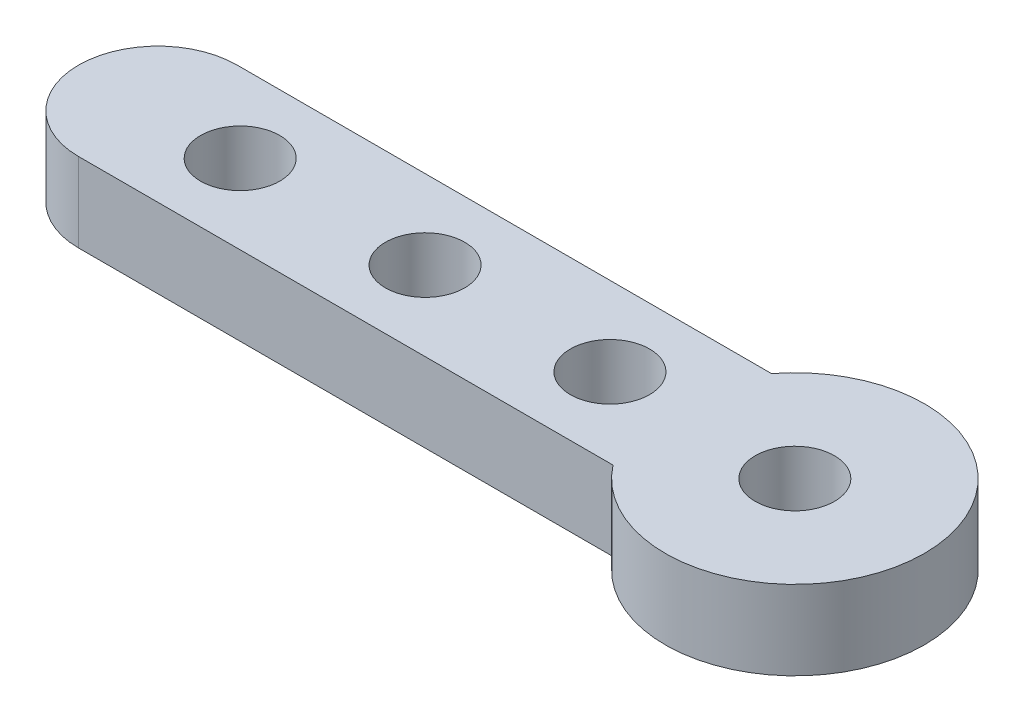
ISO-10303-21;
HEADER;
FILE_DESCRIPTION(('STEP AP214'),'2;1');
FILE_NAME('part.step','',(''),(''),'','','');
FILE_SCHEMA(('AUTOMOTIVE_DESIGN { 1 0 10303 214 1 1 1 1 }'));
ENDSEC;
DATA;
#1=APPLICATION_CONTEXT('core data for automotive mechanical design processes');
#2=APPLICATION_PROTOCOL_DEFINITION('international standard','automotive_design',2000,#1);
#3=PRODUCT_CONTEXT('',#1,'mechanical');
#4=PRODUCT('Part','Part','',(#3));
#5=PRODUCT_RELATED_PRODUCT_CATEGORY('part','',(#4));
#6=PRODUCT_DEFINITION_FORMATION('','',#4);
#7=PRODUCT_DEFINITION_CONTEXT('part definition',#1,'design');
#8=PRODUCT_DEFINITION('design','',#6,#7);
#9=PRODUCT_DEFINITION_SHAPE('','',#8);
#10=(LENGTH_UNIT() NAMED_UNIT(*) SI_UNIT(.MILLI.,.METRE.));
#11=(NAMED_UNIT(*) PLANE_ANGLE_UNIT() SI_UNIT($,.RADIAN.));
#12=(NAMED_UNIT(*) SI_UNIT($,.STERADIAN.) SOLID_ANGLE_UNIT());
#13=UNCERTAINTY_MEASURE_WITH_UNIT(LENGTH_MEASURE(1.E-05),#10,'distance_accuracy_value','');
#14=(GEOMETRIC_REPRESENTATION_CONTEXT(3) GLOBAL_UNCERTAINTY_ASSIGNED_CONTEXT((#13)) GLOBAL_UNIT_ASSIGNED_CONTEXT((#10,
#11,#12)) REPRESENTATION_CONTEXT('',''));
#15=CARTESIAN_POINT('',(0.,0.,0.));
#16=DIRECTION('',(0.,0.,1.));
#17=DIRECTION('',(1.,0.,0.));
#18=AXIS2_PLACEMENT_3D('',#15,#16,#17);
#19=CARTESIAN_POINT('',(4.88385795269048,3.,-3.));
#20=DIRECTION('',(0.,1.,0.));
#21=DIRECTION('',(0.,0.,1.));
#22=AXIS2_PLACEMENT_3D('',#19,#20,#21);
#23=PLANE('',#22);
#24=CARTESIAN_POINT('',(15.,3.,-3.));
#25=DIRECTION('',(0.,1.,0.));
#26=DIRECTION('',(0.,0.,1.));
#27=AXIS2_PLACEMENT_3D('',#24,#25,#26);
#28=CIRCLE('',#27,1.5);
#29=CARTESIAN_POINT('',(15.,3.,-1.5));
#30=VERTEX_POINT('',#29);
#31=EDGE_CURVE('E172',#30,#30,#28,.T.);
#32=ORIENTED_EDGE('',*,*,#31,.F.);
#33=EDGE_LOOP('',(#32));
#34=FACE_BOUND('',#33,.T.);
#35=CARTESIAN_POINT('',(4.88385795269048,3.,-3.));
#36=DIRECTION('',(0.,1.,0.));
#37=DIRECTION('',(0.,0.,1.));
#38=AXIS2_PLACEMENT_3D('',#35,#36,#37);
#39=CIRCLE('',#38,3.);
#40=CARTESIAN_POINT('',(4.88385795269048,3.,-6.));
#41=VERTEX_POINT('',#40);
#42=CARTESIAN_POINT('',(4.88385795269048,3.,0.));
#43=VERTEX_POINT('',#42);
#44=EDGE_CURVE('E143',#41,#43,#39,.T.);
#45=ORIENTED_EDGE('',*,*,#44,.T.);
#46=DIRECTION('',(1.,0.,0.));
#47=VECTOR('',#46,1.);
#48=CARTESIAN_POINT('',(4.88385795269048,3.,0.));
#49=LINE('',#48,#47);
#50=CARTESIAN_POINT('',(25.1161420473095,3.,0.));
#51=VERTEX_POINT('',#50);
#52=EDGE_CURVE('E135',#43,#51,#49,.T.);
#53=ORIENTED_EDGE('',*,*,#52,.T.);
#54=CARTESIAN_POINT('',(29.,3.,-3.));
#55=DIRECTION('',(0.,-1.,0.));
#56=DIRECTION('',(0.,0.,-1.));
#57=AXIS2_PLACEMENT_3D('',#54,#55,#56);
#58=CIRCLE('',#57,4.90758113500705);
#59=CARTESIAN_POINT('',(25.1161420473095,3.,-6.));
#60=VERTEX_POINT('',#59);
#61=EDGE_CURVE('E142',#60,#51,#58,.T.);
#62=ORIENTED_EDGE('',*,*,#61,.F.);
#63=DIRECTION('',(1.,0.,0.));
#64=VECTOR('',#63,1.);
#65=CARTESIAN_POINT('',(4.88385795269048,3.,-6.));
#66=LINE('',#65,#64);
#67=EDGE_CURVE('E152',#41,#60,#66,.T.);
#68=ORIENTED_EDGE('',*,*,#67,.F.);
#69=EDGE_LOOP('',(#45,#53,#62,#68));
#70=FACE_BOUND('',#69,.T.);
#71=CARTESIAN_POINT('',(8.,3.,-3.));
#72=DIRECTION('',(0.,1.,0.));
#73=DIRECTION('',(0.,0.,1.));
#74=AXIS2_PLACEMENT_3D('',#71,#72,#73);
#75=CIRCLE('',#74,1.5);
#76=CARTESIAN_POINT('',(8.,3.,-1.5));
#77=VERTEX_POINT('',#76);
#78=EDGE_CURVE('E159',#77,#77,#75,.T.);
#79=ORIENTED_EDGE('',*,*,#78,.F.);
#80=EDGE_LOOP('',(#79));
#81=FACE_BOUND('',#80,.T.);
#82=CARTESIAN_POINT('',(22.,3.,-3.));
#83=DIRECTION('',(0.,-1.,0.));
#84=DIRECTION('',(0.,0.,-1.));
#85=AXIS2_PLACEMENT_3D('',#82,#83,#84);
#86=CIRCLE('',#85,1.5);
#87=CARTESIAN_POINT('',(22.,3.,-4.5));
#88=VERTEX_POINT('',#87);
#89=EDGE_CURVE('E178',#88,#88,#86,.T.);
#90=ORIENTED_EDGE('',*,*,#89,.T.);
#91=EDGE_LOOP('',(#90));
#92=FACE_BOUND('',#91,.T.);
#93=CARTESIAN_POINT('',(29.,3.,-3.));
#94=DIRECTION('',(0.,1.,0.));
#95=DIRECTION('',(0.,0.,1.));
#96=AXIS2_PLACEMENT_3D('',#93,#94,#95);
#97=CIRCLE('',#96,1.5);
#98=CARTESIAN_POINT('',(29.,3.,-1.5));
#99=VERTEX_POINT('',#98);
#100=EDGE_CURVE('E184',#99,#99,#97,.T.);
#101=ORIENTED_EDGE('',*,*,#100,.F.);
#102=EDGE_LOOP('',(#101));
#103=FACE_BOUND('',#102,.T.);
#104=ADVANCED_FACE('F93',(#34,#70,#81,#92,#103),#23,.T.);
#105=CARTESIAN_POINT('',(4.88385795269048,0.,-3.));
#106=DIRECTION('',(0.,1.,0.));
#107=DIRECTION('',(0.,0.,1.));
#108=AXIS2_PLACEMENT_3D('',#105,#106,#107);
#109=PLANE('',#108);
#110=CARTESIAN_POINT('',(22.,0.,-3.));
#111=DIRECTION('',(0.,-1.,0.));
#112=DIRECTION('',(0.,0.,-1.));
#113=AXIS2_PLACEMENT_3D('',#110,#111,#112);
#114=CIRCLE('',#113,1.5);
#115=CARTESIAN_POINT('',(22.,0.,-4.5));
#116=VERTEX_POINT('',#115);
#117=EDGE_CURVE('E181',#116,#116,#114,.T.);
#118=ORIENTED_EDGE('',*,*,#117,.F.);
#119=EDGE_LOOP('',(#118));
#120=FACE_BOUND('',#119,.T.);
#121=CARTESIAN_POINT('',(4.88385795269048,0.,-3.));
#122=DIRECTION('',(0.,1.,0.));
#123=DIRECTION('',(0.,0.,1.));
#124=AXIS2_PLACEMENT_3D('',#121,#122,#123);
#125=CIRCLE('',#124,3.);
#126=CARTESIAN_POINT('',(4.88385795269048,0.,-6.));
#127=VERTEX_POINT('',#126);
#128=CARTESIAN_POINT('',(4.88385795269048,0.,0.));
#129=VERTEX_POINT('',#128);
#130=EDGE_CURVE('E157',#127,#129,#125,.T.);
#131=ORIENTED_EDGE('',*,*,#130,.F.);
#132=DIRECTION('',(1.,0.,0.));
#133=VECTOR('',#132,1.);
#134=CARTESIAN_POINT('',(4.88385795269048,0.,-6.));
#135=LINE('',#134,#133);
#136=CARTESIAN_POINT('',(25.1161420473095,0.,-6.));
#137=VERTEX_POINT('',#136);
#138=EDGE_CURVE('E163',#127,#137,#135,.T.);
#139=ORIENTED_EDGE('',*,*,#138,.T.);
#140=CARTESIAN_POINT('',(29.,0.,-3.));
#141=DIRECTION('',(0.,-1.,0.));
#142=DIRECTION('',(0.,0.,-1.));
#143=AXIS2_PLACEMENT_3D('',#140,#141,#142);
#144=CIRCLE('',#143,4.90758113500705);
#145=CARTESIAN_POINT('',(25.1161420473095,0.,0.));
#146=VERTEX_POINT('',#145);
#147=EDGE_CURVE('E161',#137,#146,#144,.T.);
#148=ORIENTED_EDGE('',*,*,#147,.T.);
#149=DIRECTION('',(1.,0.,0.));
#150=VECTOR('',#149,1.);
#151=CARTESIAN_POINT('',(4.88385795269048,0.,0.));
#152=LINE('',#151,#150);
#153=EDGE_CURVE('E148',#129,#146,#152,.T.);
#154=ORIENTED_EDGE('',*,*,#153,.F.);
#155=EDGE_LOOP('',(#131,#139,#148,#154));
#156=FACE_BOUND('',#155,.T.);
#157=CARTESIAN_POINT('',(8.,0.,-3.));
#158=DIRECTION('',(0.,1.,0.));
#159=DIRECTION('',(0.,0.,1.));
#160=AXIS2_PLACEMENT_3D('',#157,#158,#159);
#161=CIRCLE('',#160,1.5);
#162=CARTESIAN_POINT('',(8.,0.,-1.5));
#163=VERTEX_POINT('',#162);
#164=EDGE_CURVE('E169',#163,#163,#161,.T.);
#165=ORIENTED_EDGE('',*,*,#164,.T.);
#166=EDGE_LOOP('',(#165));
#167=FACE_BOUND('',#166,.T.);
#168=CARTESIAN_POINT('',(15.,0.,-3.));
#169=DIRECTION('',(0.,1.,0.));
#170=DIRECTION('',(0.,0.,1.));
#171=AXIS2_PLACEMENT_3D('',#168,#169,#170);
#172=CIRCLE('',#171,1.5);
#173=CARTESIAN_POINT('',(15.,0.,-1.5));
#174=VERTEX_POINT('',#173);
#175=EDGE_CURVE('E175',#174,#174,#172,.T.);
#176=ORIENTED_EDGE('',*,*,#175,.T.);
#177=EDGE_LOOP('',(#176));
#178=FACE_BOUND('',#177,.T.);
#179=CARTESIAN_POINT('',(29.,0.,-3.));
#180=DIRECTION('',(0.,1.,0.));
#181=DIRECTION('',(0.,0.,1.));
#182=AXIS2_PLACEMENT_3D('',#179,#180,#181);
#183=CIRCLE('',#182,1.5);
#184=CARTESIAN_POINT('',(29.,0.,-1.5));
#185=VERTEX_POINT('',#184);
#186=EDGE_CURVE('E187',#185,#185,#183,.T.);
#187=ORIENTED_EDGE('',*,*,#186,.T.);
#188=EDGE_LOOP('',(#187));
#189=FACE_BOUND('',#188,.T.);
#190=ADVANCED_FACE('F197',(#120,#156,#167,#178,#189),#109,.F.);
#191=CARTESIAN_POINT('',(4.88385795269048,3.,-3.));
#192=DIRECTION('',(0.,-1.,0.));
#193=DIRECTION('',(0.,0.,-1.));
#194=AXIS2_PLACEMENT_3D('',#191,#192,#193);
#195=CYLINDRICAL_SURFACE('',#194,3.);
#196=ORIENTED_EDGE('',*,*,#130,.T.);
#197=DIRECTION('',(0.,-1.,0.));
#198=VECTOR('',#197,1.);
#199=CARTESIAN_POINT('',(4.88385795269048,3.,0.));
#200=LINE('',#199,#198);
#201=EDGE_CURVE('E12',#43,#129,#200,.T.);
#202=ORIENTED_EDGE('',*,*,#201,.F.);
#203=ORIENTED_EDGE('',*,*,#44,.F.);
#204=DIRECTION('',(0.,-1.,0.));
#205=VECTOR('',#204,1.);
#206=CARTESIAN_POINT('',(4.88385795269048,3.,-6.));
#207=LINE('',#206,#205);
#208=EDGE_CURVE('E110',#41,#127,#207,.T.);
#209=ORIENTED_EDGE('',*,*,#208,.T.);
#210=EDGE_LOOP('',(#196,#202,#203,#209));
#211=FACE_BOUND('',#210,.T.);
#212=ADVANCED_FACE('F95',(#211),#195,.T.);
#213=CARTESIAN_POINT('',(4.88385795269048,3.,0.));
#214=DIRECTION('',(0.,0.,-1.));
#215=DIRECTION('',(-1.,0.,0.));
#216=AXIS2_PLACEMENT_3D('',#213,#214,#215);
#217=PLANE('',#216);
#218=ORIENTED_EDGE('',*,*,#153,.T.);
#219=DIRECTION('',(0.,-1.,0.));
#220=VECTOR('',#219,1.);
#221=CARTESIAN_POINT('',(25.1161420473095,3.,0.));
#222=LINE('',#221,#220);
#223=EDGE_CURVE('E102',#51,#146,#222,.T.);
#224=ORIENTED_EDGE('',*,*,#223,.F.);
#225=ORIENTED_EDGE('',*,*,#52,.F.);
#226=ORIENTED_EDGE('',*,*,#201,.T.);
#227=EDGE_LOOP('',(#218,#224,#225,#226));
#228=FACE_BOUND('',#227,.T.);
#229=ADVANCED_FACE('F147',(#228),#217,.F.);
#230=CARTESIAN_POINT('',(29.,3.,-3.));
#231=DIRECTION('',(0.,-1.,0.));
#232=DIRECTION('',(0.,0.,-1.));
#233=AXIS2_PLACEMENT_3D('',#230,#231,#232);
#234=CYLINDRICAL_SURFACE('',#233,4.90758113500705);
#235=ORIENTED_EDGE('',*,*,#147,.F.);
#236=DIRECTION('',(0.,-1.,0.));
#237=VECTOR('',#236,1.);
#238=CARTESIAN_POINT('',(25.1161420473095,3.,-6.));
#239=LINE('',#238,#237);
#240=EDGE_CURVE('E124',#60,#137,#239,.T.);
#241=ORIENTED_EDGE('',*,*,#240,.F.);
#242=ORIENTED_EDGE('',*,*,#61,.T.);
#243=ORIENTED_EDGE('',*,*,#223,.T.);
#244=EDGE_LOOP('',(#235,#241,#242,#243));
#245=FACE_BOUND('',#244,.T.);
#246=ADVANCED_FACE('F151',(#245),#234,.T.);
#247=CARTESIAN_POINT('',(4.88385795269048,3.,-6.));
#248=DIRECTION('',(0.,0.,-1.));
#249=DIRECTION('',(-1.,0.,0.));
#250=AXIS2_PLACEMENT_3D('',#247,#248,#249);
#251=PLANE('',#250);
#252=ORIENTED_EDGE('',*,*,#138,.F.);
#253=ORIENTED_EDGE('',*,*,#208,.F.);
#254=ORIENTED_EDGE('',*,*,#67,.T.);
#255=ORIENTED_EDGE('',*,*,#240,.T.);
#256=EDGE_LOOP('',(#252,#253,#254,#255));
#257=FACE_BOUND('',#256,.T.);
#258=ADVANCED_FACE('F210',(#257),#251,.T.);
#259=CARTESIAN_POINT('',(8.,3.,-3.));
#260=DIRECTION('',(0.,-1.,0.));
#261=DIRECTION('',(0.,0.,-1.));
#262=AXIS2_PLACEMENT_3D('',#259,#260,#261);
#263=CYLINDRICAL_SURFACE('',#262,1.5);
#264=ORIENTED_EDGE('',*,*,#78,.T.);
#265=EDGE_LOOP('',(#264));
#266=FACE_BOUND('',#265,.T.);
#267=ORIENTED_EDGE('',*,*,#164,.F.);
#268=EDGE_LOOP('',(#267));
#269=FACE_BOUND('',#268,.T.);
#270=ADVANCED_FACE('F207',(#266,#269),#263,.F.);
#271=CARTESIAN_POINT('',(15.,3.,-3.));
#272=DIRECTION('',(0.,-1.,0.));
#273=DIRECTION('',(0.,0.,-1.));
#274=AXIS2_PLACEMENT_3D('',#271,#272,#273);
#275=CYLINDRICAL_SURFACE('',#274,1.5);
#276=ORIENTED_EDGE('',*,*,#31,.T.);
#277=EDGE_LOOP('',(#276));
#278=FACE_BOUND('',#277,.T.);
#279=ORIENTED_EDGE('',*,*,#175,.F.);
#280=EDGE_LOOP('',(#279));
#281=FACE_BOUND('',#280,.T.);
#282=ADVANCED_FACE('F232',(#278,#281),#275,.F.);
#283=CARTESIAN_POINT('',(22.,3.,-3.));
#284=DIRECTION('',(0.,-1.,0.));
#285=DIRECTION('',(0.,0.,-1.));
#286=AXIS2_PLACEMENT_3D('',#283,#284,#285);
#287=CYLINDRICAL_SURFACE('',#286,1.5);
#288=ORIENTED_EDGE('',*,*,#89,.F.);
#289=EDGE_LOOP('',(#288));
#290=FACE_BOUND('',#289,.T.);
#291=ORIENTED_EDGE('',*,*,#117,.T.);
#292=EDGE_LOOP('',(#291));
#293=FACE_BOUND('',#292,.T.);
#294=ADVANCED_FACE('F227',(#290,#293),#287,.F.);
#295=CARTESIAN_POINT('',(29.,3.,-3.));
#296=DIRECTION('',(0.,-1.,0.));
#297=DIRECTION('',(0.,0.,-1.));
#298=AXIS2_PLACEMENT_3D('',#295,#296,#297);
#299=CYLINDRICAL_SURFACE('',#298,1.5);
#300=ORIENTED_EDGE('',*,*,#100,.T.);
#301=EDGE_LOOP('',(#300));
#302=FACE_BOUND('',#301,.T.);
#303=ORIENTED_EDGE('',*,*,#186,.F.);
#304=EDGE_LOOP('',(#303));
#305=FACE_BOUND('',#304,.T.);
#306=ADVANCED_FACE('F193',(#302,#305),#299,.F.);
#307=CLOSED_SHELL('',(#104,#190,#212,#229,#246,#258,#270,#282,#294,#306));
#308=MANIFOLD_SOLID_BREP('B2',#307);
#309=ADVANCED_BREP_SHAPE_REPRESENTATION('',(#18,#308),#14);
#310=SHAPE_DEFINITION_REPRESENTATION(#9,#309);
ENDSEC;
END-ISO-10303-21;
